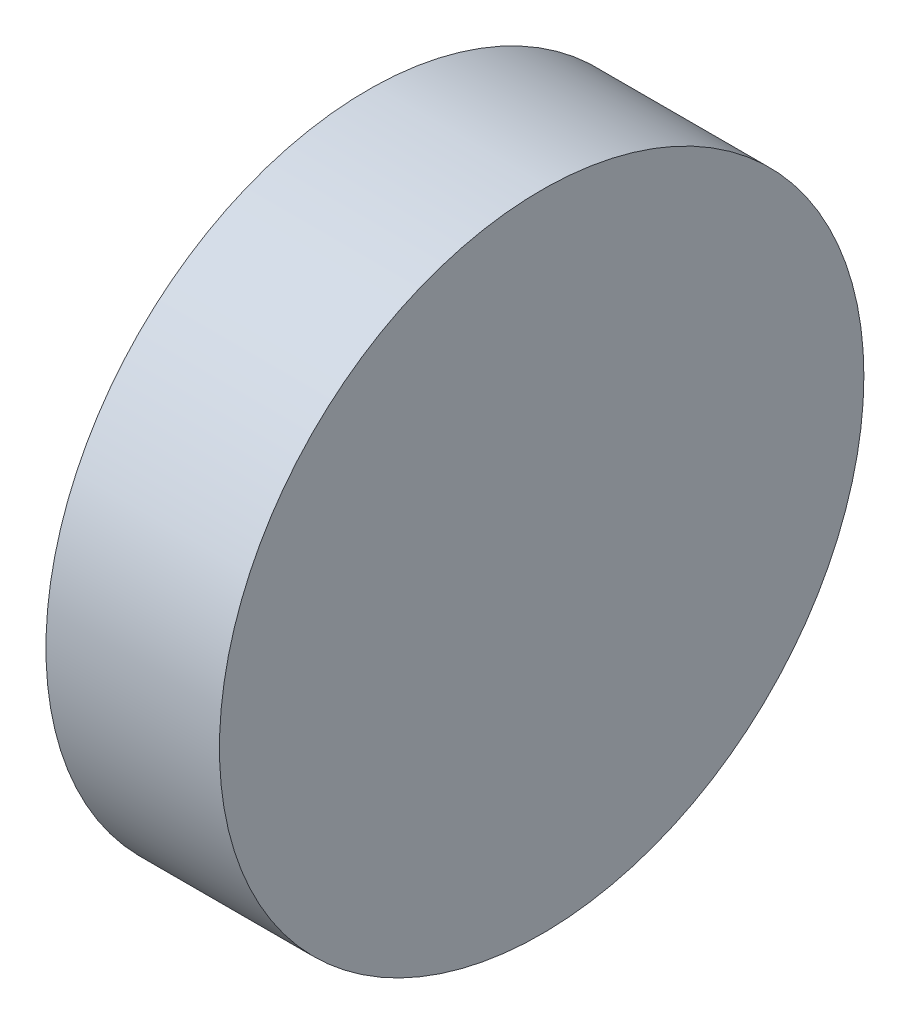
ISO-10303-21;
HEADER;
FILE_DESCRIPTION(('STEP AP214'),'2;1');
FILE_NAME('part.step','',(''),(''),'','','');
FILE_SCHEMA(('AUTOMOTIVE_DESIGN { 1 0 10303 214 1 1 1 1 }'));
ENDSEC;
DATA;
#1=APPLICATION_CONTEXT('core data for automotive mechanical design processes');
#2=APPLICATION_PROTOCOL_DEFINITION('international standard','automotive_design',2000,#1);
#3=PRODUCT_CONTEXT('',#1,'mechanical');
#4=PRODUCT('Part','Part','',(#3));
#5=PRODUCT_RELATED_PRODUCT_CATEGORY('part','',(#4));
#6=PRODUCT_DEFINITION_FORMATION('','',#4);
#7=PRODUCT_DEFINITION_CONTEXT('part definition',#1,'design');
#8=PRODUCT_DEFINITION('design','',#6,#7);
#9=PRODUCT_DEFINITION_SHAPE('','',#8);
#10=(LENGTH_UNIT() NAMED_UNIT(*) SI_UNIT(.MILLI.,.METRE.));
#11=(NAMED_UNIT(*) PLANE_ANGLE_UNIT() SI_UNIT($,.RADIAN.));
#12=(NAMED_UNIT(*) SI_UNIT($,.STERADIAN.) SOLID_ANGLE_UNIT());
#13=UNCERTAINTY_MEASURE_WITH_UNIT(LENGTH_MEASURE(1.E-05),#10,'distance_accuracy_value','');
#14=(GEOMETRIC_REPRESENTATION_CONTEXT(3) GLOBAL_UNCERTAINTY_ASSIGNED_CONTEXT((#13)) GLOBAL_UNIT_ASSIGNED_CONTEXT((#10,
#11,#12)) REPRESENTATION_CONTEXT('',''));
#15=CARTESIAN_POINT('',(0.,0.,0.));
#16=DIRECTION('',(0.,0.,1.));
#17=DIRECTION('',(1.,0.,0.));
#18=AXIS2_PLACEMENT_3D('',#15,#16,#17);
#19=CARTESIAN_POINT('',(88.9,0.,0.));
#20=DIRECTION('',(-1.,0.,0.));
#21=DIRECTION('',(0.,0.,1.));
#22=AXIS2_PLACEMENT_3D('',#19,#20,#21);
#23=CYLINDRICAL_SURFACE('',#22,165.1);
#24=CARTESIAN_POINT('',(88.9,0.,0.));
#25=DIRECTION('',(1.,0.,0.));
#26=DIRECTION('',(0.,0.,-1.));
#27=AXIS2_PLACEMENT_3D('',#24,#25,#26);
#28=CIRCLE('',#27,165.1);
#29=CARTESIAN_POINT('',(88.9,0.,-165.1));
#30=VERTEX_POINT('',#29);
#31=EDGE_CURVE('E10',#30,#30,#28,.T.);
#32=ORIENTED_EDGE('',*,*,#31,.F.);
#33=EDGE_LOOP('',(#32));
#34=FACE_BOUND('',#33,.T.);
#35=CARTESIAN_POINT('',(0.,0.,0.));
#36=DIRECTION('',(1.,0.,0.));
#37=DIRECTION('',(0.,0.,-1.));
#38=AXIS2_PLACEMENT_3D('',#35,#36,#37);
#39=CIRCLE('',#38,165.1);
#40=CARTESIAN_POINT('',(0.,0.,-165.1));
#41=VERTEX_POINT('',#40);
#42=EDGE_CURVE('E34',#41,#41,#39,.T.);
#43=ORIENTED_EDGE('',*,*,#42,.T.);
#44=EDGE_LOOP('',(#43));
#45=FACE_BOUND('',#44,.T.);
#46=ADVANCED_FACE('F31',(#34,#45),#23,.T.);
#47=CARTESIAN_POINT('',(88.9,0.,0.));
#48=DIRECTION('',(1.,0.,0.));
#49=DIRECTION('',(0.,0.,-1.));
#50=AXIS2_PLACEMENT_3D('',#47,#48,#49);
#51=PLANE('',#50);
#52=ORIENTED_EDGE('',*,*,#31,.T.);
#53=EDGE_LOOP('',(#52));
#54=FACE_BOUND('',#53,.T.);
#55=ADVANCED_FACE('F46',(#54),#51,.T.);
#56=CARTESIAN_POINT('',(0.,0.,0.));
#57=DIRECTION('',(1.,0.,0.));
#58=DIRECTION('',(0.,0.,-1.));
#59=AXIS2_PLACEMENT_3D('',#56,#57,#58);
#60=PLANE('',#59);
#61=ORIENTED_EDGE('',*,*,#42,.F.);
#62=EDGE_LOOP('',(#61));
#63=FACE_BOUND('',#62,.T.);
#64=ADVANCED_FACE('F44',(#63),#60,.F.);
#65=CLOSED_SHELL('',(#46,#55,#64));
#66=MANIFOLD_SOLID_BREP('B2',#65);
#67=ADVANCED_BREP_SHAPE_REPRESENTATION('',(#18,#66),#14);
#68=SHAPE_DEFINITION_REPRESENTATION(#9,#67);
ENDSEC;
END-ISO-10303-21;
